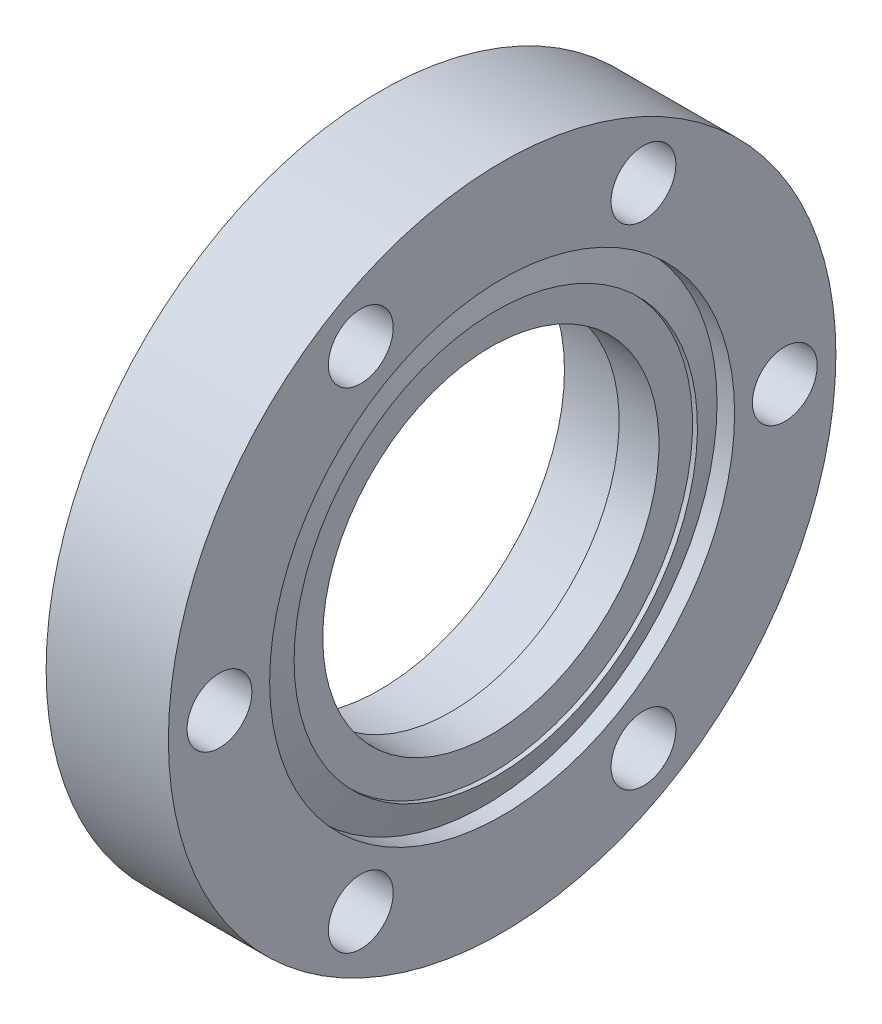
ISO-10303-21;
HEADER;
FILE_DESCRIPTION(('STEP AP214'),'2;1');
FILE_NAME('part.step','',(''),(''),'','','');
FILE_SCHEMA(('AUTOMOTIVE_DESIGN { 1 0 10303 214 1 1 1 1 }'));
ENDSEC;
DATA;
#1=APPLICATION_CONTEXT('core data for automotive mechanical design processes');
#2=APPLICATION_PROTOCOL_DEFINITION('international standard','automotive_design',2000,#1);
#3=PRODUCT_CONTEXT('',#1,'mechanical');
#4=PRODUCT('Part','Part','',(#3));
#5=PRODUCT_RELATED_PRODUCT_CATEGORY('part','',(#4));
#6=PRODUCT_DEFINITION_FORMATION('','',#4);
#7=PRODUCT_DEFINITION_CONTEXT('part definition',#1,'design');
#8=PRODUCT_DEFINITION('design','',#6,#7);
#9=PRODUCT_DEFINITION_SHAPE('','',#8);
#10=(LENGTH_UNIT() NAMED_UNIT(*) SI_UNIT(.MILLI.,.METRE.));
#11=(NAMED_UNIT(*) PLANE_ANGLE_UNIT() SI_UNIT($,.RADIAN.));
#12=(NAMED_UNIT(*) SI_UNIT($,.STERADIAN.) SOLID_ANGLE_UNIT());
#13=UNCERTAINTY_MEASURE_WITH_UNIT(LENGTH_MEASURE(1.E-05),#10,'distance_accuracy_value','');
#14=(GEOMETRIC_REPRESENTATION_CONTEXT(3) GLOBAL_UNCERTAINTY_ASSIGNED_CONTEXT((#13)) GLOBAL_UNIT_ASSIGNED_CONTEXT((#10,
#11,#12)) REPRESENTATION_CONTEXT('',''));
#15=CARTESIAN_POINT('',(0.,0.,0.));
#16=DIRECTION('',(0.,0.,1.));
#17=DIRECTION('',(1.,0.,0.));
#18=AXIS2_PLACEMENT_3D('',#15,#16,#17);
#19=CARTESIAN_POINT('',(5.18000000000051,-19.2062500000005,0.));
#20=DIRECTION('',(1.,0.,0.));
#21=DIRECTION('',(0.,0.,-1.));
#22=AXIS2_PLACEMENT_3D('',#19,#20,#21);
#23=PLANE('',#22);
#24=CARTESIAN_POINT('',(5.18000000000051,0.,0.));
#25=DIRECTION('',(-1.,0.,0.));
#26=DIRECTION('',(0.,0.,1.));
#27=AXIS2_PLACEMENT_3D('',#24,#25,#26);
#28=CIRCLE('',#27,17.4625);
#29=CARTESIAN_POINT('',(5.18000000000051,0.,17.4625));
#30=VERTEX_POINT('',#29);
#31=EDGE_CURVE('E18',#30,#30,#28,.T.);
#32=ORIENTED_EDGE('',*,*,#31,.T.);
#33=EDGE_LOOP('',(#32));
#34=FACE_BOUND('',#33,.T.);
#35=CARTESIAN_POINT('',(5.18000000000051,0.,0.));
#36=DIRECTION('',(-1.,0.,0.));
#37=DIRECTION('',(0.,0.,1.));
#38=AXIS2_PLACEMENT_3D('',#35,#36,#37);
#39=CIRCLE('',#38,20.950000000001);
#40=CARTESIAN_POINT('',(5.18000000000051,0.,20.950000000001));
#41=VERTEX_POINT('',#40);
#42=EDGE_CURVE('E81',#41,#41,#39,.F.);
#43=ORIENTED_EDGE('',*,*,#42,.T.);
#44=EDGE_LOOP('',(#43));
#45=FACE_BOUND('',#44,.T.);
#46=ADVANCED_FACE('F14',(#34,#45),#23,.T.);
#47=CARTESIAN_POINT('',(3.11069999999995,0.,0.));
#48=DIRECTION('',(-1.,0.,0.));
#49=DIRECTION('',(0.,0.,1.));
#50=AXIS2_PLACEMENT_3D('',#47,#48,#49);
#51=CYLINDRICAL_SURFACE('',#50,17.4625);
#52=CARTESIAN_POINT('',(1.04139999999939,0.,0.));
#53=DIRECTION('',(-1.,0.,0.));
#54=DIRECTION('',(0.,0.,1.));
#55=AXIS2_PLACEMENT_3D('',#52,#53,#54);
#56=CIRCLE('',#55,17.4625);
#57=CARTESIAN_POINT('',(1.04139999999939,0.,17.4625));
#58=VERTEX_POINT('',#57);
#59=EDGE_CURVE('E79',#58,#58,#56,.F.);
#60=ORIENTED_EDGE('',*,*,#59,.F.);
#61=EDGE_LOOP('',(#60));
#62=FACE_BOUND('',#61,.T.);
#63=ORIENTED_EDGE('',*,*,#31,.F.);
#64=EDGE_LOOP('',(#63));
#65=FACE_BOUND('',#64,.T.);
#66=ADVANCED_FACE('F89',(#62,#65),#51,.F.);
#67=CARTESIAN_POINT('',(5.43499999999988,0.,0.));
#68=DIRECTION('',(-1.,0.,0.));
#69=DIRECTION('',(0.,0.,1.));
#70=AXIS2_PLACEMENT_3D('',#67,#68,#69);
#71=CYLINDRICAL_SURFACE('',#70,20.950000000001);
#72=ORIENTED_EDGE('',*,*,#42,.F.);
#73=EDGE_LOOP('',(#72));
#74=FACE_BOUND('',#73,.T.);
#75=CARTESIAN_POINT('',(5.69000000223288,0.,0.));
#76=DIRECTION('',(-1.,0.,0.));
#77=DIRECTION('',(0.,-1.,0.));
#78=AXIS2_PLACEMENT_3D('',#75,#76,#77);
#79=CIRCLE('',#78,20.950000000814);
#80=CARTESIAN_POINT('',(5.69000000223288,-20.950000000814,0.));
#81=VERTEX_POINT('',#80);
#82=EDGE_CURVE('E78',#81,#81,#79,.T.);
#83=ORIENTED_EDGE('',*,*,#82,.F.);
#84=EDGE_LOOP('',(#83));
#85=FACE_BOUND('',#84,.T.);
#86=ADVANCED_FACE('F91',(#74,#85),#71,.F.);
#87=CARTESIAN_POINT('',(1.04139999999939,-18.3197499999999,0.));
#88=DIRECTION('',(-1.,0.,0.));
#89=DIRECTION('',(0.,0.,1.));
#90=AXIS2_PLACEMENT_3D('',#87,#88,#89);
#91=PLANE('',#90);
#92=ORIENTED_EDGE('',*,*,#59,.T.);
#93=EDGE_LOOP('',(#92));
#94=FACE_BOUND('',#93,.T.);
#95=CARTESIAN_POINT('',(1.04139999999939,0.,0.));
#96=DIRECTION('',(-1.,0.,0.));
#97=DIRECTION('',(0.,0.,1.));
#98=AXIS2_PLACEMENT_3D('',#95,#96,#97);
#99=CIRCLE('',#98,19.1769999999999);
#100=CARTESIAN_POINT('',(1.04139999999939,0.,19.1769999999999));
#101=VERTEX_POINT('',#100);
#102=EDGE_CURVE('E75',#101,#101,#99,.T.);
#103=ORIENTED_EDGE('',*,*,#102,.T.);
#104=EDGE_LOOP('',(#103));
#105=FACE_BOUND('',#104,.T.);
#106=ADVANCED_FACE('F99',(#94,#105),#91,.T.);
#107=CARTESIAN_POINT('',(4.52529524811392,0.,0.));
#108=DIRECTION('',(-1.,0.,0.));
#109=DIRECTION('',(0.,0.,1.));
#110=AXIS2_PLACEMENT_3D('',#107,#108,#109);
#111=CONICAL_SURFACE('',#110,24.1499999991873,1.22173047499998);
#112=ORIENTED_EDGE('',*,*,#82,.T.);
#113=EDGE_LOOP('',(#112));
#114=FACE_BOUND('',#113,.T.);
#115=CARTESIAN_POINT('',(4.52529525034756,0.,0.));
#116=DIRECTION('',(-1.,0.,0.));
#117=DIRECTION('',(0.,0.,1.));
#118=AXIS2_PLACEMENT_3D('',#115,#116,#117);
#119=CIRCLE('',#118,24.1500000000003);
#120=CARTESIAN_POINT('',(4.52529525034756,0.,24.1500000000003));
#121=VERTEX_POINT('',#120);
#122=EDGE_CURVE('E74',#121,#121,#119,.F.);
#123=ORIENTED_EDGE('',*,*,#122,.T.);
#124=EDGE_LOOP('',(#123));
#125=FACE_BOUND('',#124,.T.);
#126=ADVANCED_FACE('F127',(#114,#125),#111,.T.);
#127=CARTESIAN_POINT('',(-2.65429999999995,0.,0.));
#128=DIRECTION('',(-1.,0.,0.));
#129=DIRECTION('',(0.,0.,1.));
#130=AXIS2_PLACEMENT_3D('',#127,#128,#129);
#131=CYLINDRICAL_SURFACE('',#130,19.1769999999999);
#132=CARTESIAN_POINT('',(-6.34999999999929,0.,0.));
#133=DIRECTION('',(-1.,0.,0.));
#134=DIRECTION('',(0.,0.,1.));
#135=AXIS2_PLACEMENT_3D('',#132,#133,#134);
#136=CIRCLE('',#135,19.1769999999999);
#137=CARTESIAN_POINT('',(-6.34999999999929,0.,19.1769999999999));
#138=VERTEX_POINT('',#137);
#139=EDGE_CURVE('E53',#138,#138,#136,.F.);
#140=ORIENTED_EDGE('',*,*,#139,.F.);
#141=EDGE_LOOP('',(#140));
#142=FACE_BOUND('',#141,.T.);
#143=ORIENTED_EDGE('',*,*,#102,.F.);
#144=EDGE_LOOP('',(#143));
#145=FACE_BOUND('',#144,.T.);
#146=ADVANCED_FACE('F123',(#142,#145),#131,.F.);
#147=CARTESIAN_POINT('',(6.34999999999939,-25.4285843160799,14.6811999999998));
#148=DIRECTION('',(-1.,0.,0.));
#149=DIRECTION('',(0.,0.,1.));
#150=AXIS2_PLACEMENT_3D('',#147,#148,#149);
#151=CYLINDRICAL_SURFACE('',#150,3.36550000000002);
#152=CARTESIAN_POINT('',(6.34999999999937,-25.4285843160799,14.6811999999998));
#153=DIRECTION('',(-1.,0.,0.));
#154=DIRECTION('',(0.,0.,1.));
#155=AXIS2_PLACEMENT_3D('',#152,#153,#154);
#156=CIRCLE('',#155,3.36550000000002);
#157=CARTESIAN_POINT('',(6.34999999999937,-25.4285843160799,18.0466999999999));
#158=VERTEX_POINT('',#157);
#159=EDGE_CURVE('E50',#158,#158,#156,.T.);
#160=ORIENTED_EDGE('',*,*,#159,.F.);
#161=EDGE_LOOP('',(#160));
#162=FACE_BOUND('',#161,.T.);
#163=CARTESIAN_POINT('',(-6.34999999999929,-25.4285843160799,14.6811999999998));
#164=DIRECTION('',(-1.,0.,0.));
#165=DIRECTION('',(0.,0.,1.));
#166=AXIS2_PLACEMENT_3D('',#163,#164,#165);
#167=CIRCLE('',#166,3.36550000000002);
#168=CARTESIAN_POINT('',(-6.34999999999929,-25.4285843160799,18.0466999999999));
#169=VERTEX_POINT('',#168);
#170=EDGE_CURVE('E71',#169,#169,#167,.F.);
#171=ORIENTED_EDGE('',*,*,#170,.F.);
#172=EDGE_LOOP('',(#171));
#173=FACE_BOUND('',#172,.T.);
#174=ADVANCED_FACE('F126',(#162,#173),#151,.F.);
#175=CARTESIAN_POINT('',(6.34999999999939,0.,29.3623999999996));
#176=DIRECTION('',(-1.,0.,0.));
#177=DIRECTION('',(0.,0.,1.));
#178=AXIS2_PLACEMENT_3D('',#175,#176,#177);
#179=CYLINDRICAL_SURFACE('',#178,3.3655);
#180=CARTESIAN_POINT('',(6.34999999999937,0.,29.3623999999996));
#181=DIRECTION('',(-1.,0.,0.));
#182=DIRECTION('',(0.,0.,1.));
#183=AXIS2_PLACEMENT_3D('',#180,#181,#182);
#184=CIRCLE('',#183,3.3655);
#185=CARTESIAN_POINT('',(6.34999999999937,0.,32.7278999999996));
#186=VERTEX_POINT('',#185);
#187=EDGE_CURVE('E47',#186,#186,#184,.T.);
#188=ORIENTED_EDGE('',*,*,#187,.F.);
#189=EDGE_LOOP('',(#188));
#190=FACE_BOUND('',#189,.T.);
#191=CARTESIAN_POINT('',(-6.34999999999929,0.,29.3623999999996));
#192=DIRECTION('',(-1.,0.,0.));
#193=DIRECTION('',(0.,0.,1.));
#194=AXIS2_PLACEMENT_3D('',#191,#192,#193);
#195=CIRCLE('',#194,3.3655);
#196=CARTESIAN_POINT('',(-6.34999999999929,0.,32.7278999999996));
#197=VERTEX_POINT('',#196);
#198=EDGE_CURVE('E68',#197,#197,#195,.F.);
#199=ORIENTED_EDGE('',*,*,#198,.F.);
#200=EDGE_LOOP('',(#199));
#201=FACE_BOUND('',#200,.T.);
#202=ADVANCED_FACE('F158',(#190,#201),#179,.F.);
#203=CARTESIAN_POINT('',(6.34999999999939,25.4285843160799,14.6811999999998));
#204=DIRECTION('',(-1.,0.,0.));
#205=DIRECTION('',(0.,0.,1.));
#206=AXIS2_PLACEMENT_3D('',#203,#204,#205);
#207=CYLINDRICAL_SURFACE('',#206,3.36549999999999);
#208=CARTESIAN_POINT('',(6.34999999999937,25.4285843160799,14.6811999999998));
#209=DIRECTION('',(-1.,0.,0.));
#210=DIRECTION('',(0.,0.,1.));
#211=AXIS2_PLACEMENT_3D('',#208,#209,#210);
#212=CIRCLE('',#211,3.36549999999999);
#213=CARTESIAN_POINT('',(6.34999999999937,25.4285843160799,18.0466999999998));
#214=VERTEX_POINT('',#213);
#215=EDGE_CURVE('E44',#214,#214,#212,.T.);
#216=ORIENTED_EDGE('',*,*,#215,.F.);
#217=EDGE_LOOP('',(#216));
#218=FACE_BOUND('',#217,.T.);
#219=CARTESIAN_POINT('',(-6.34999999999929,25.4285843160799,14.6811999999998));
#220=DIRECTION('',(-1.,0.,0.));
#221=DIRECTION('',(0.,0.,1.));
#222=AXIS2_PLACEMENT_3D('',#219,#220,#221);
#223=CIRCLE('',#222,3.36549999999999);
#224=CARTESIAN_POINT('',(-6.34999999999929,25.4285843160799,18.0466999999998));
#225=VERTEX_POINT('',#224);
#226=EDGE_CURVE('E65',#225,#225,#223,.F.);
#227=ORIENTED_EDGE('',*,*,#226,.F.);
#228=EDGE_LOOP('',(#227));
#229=FACE_BOUND('',#228,.T.);
#230=ADVANCED_FACE('F166',(#218,#229),#207,.F.);
#231=CARTESIAN_POINT('',(6.34999999999939,25.4285843160799,-14.6811999999998));
#232=DIRECTION('',(-1.,0.,0.));
#233=DIRECTION('',(0.,0.,1.));
#234=AXIS2_PLACEMENT_3D('',#231,#232,#233);
#235=CYLINDRICAL_SURFACE('',#234,3.3655);
#236=CARTESIAN_POINT('',(6.34999999999937,25.4285843160799,-14.6811999999998));
#237=DIRECTION('',(-1.,0.,0.));
#238=DIRECTION('',(0.,0.,1.));
#239=AXIS2_PLACEMENT_3D('',#236,#237,#238);
#240=CIRCLE('',#239,3.3655);
#241=CARTESIAN_POINT('',(6.34999999999937,25.4285843160799,-11.3156999999998));
#242=VERTEX_POINT('',#241);
#243=EDGE_CURVE('E41',#242,#242,#240,.T.);
#244=ORIENTED_EDGE('',*,*,#243,.F.);
#245=EDGE_LOOP('',(#244));
#246=FACE_BOUND('',#245,.T.);
#247=CARTESIAN_POINT('',(-6.34999999999929,25.4285843160799,-14.6811999999998));
#248=DIRECTION('',(-1.,0.,0.));
#249=DIRECTION('',(0.,0.,1.));
#250=AXIS2_PLACEMENT_3D('',#247,#248,#249);
#251=CIRCLE('',#250,3.3655);
#252=CARTESIAN_POINT('',(-6.34999999999929,25.4285843160799,-11.3156999999998));
#253=VERTEX_POINT('',#252);
#254=EDGE_CURVE('E62',#253,#253,#251,.F.);
#255=ORIENTED_EDGE('',*,*,#254,.F.);
#256=EDGE_LOOP('',(#255));
#257=FACE_BOUND('',#256,.T.);
#258=ADVANCED_FACE('F174',(#246,#257),#235,.F.);
#259=CARTESIAN_POINT('',(6.34999999999939,-25.4285843160799,-14.6811999999998));
#260=DIRECTION('',(-1.,0.,0.));
#261=DIRECTION('',(0.,0.,1.));
#262=AXIS2_PLACEMENT_3D('',#259,#260,#261);
#263=CYLINDRICAL_SURFACE('',#262,3.3655);
#264=CARTESIAN_POINT('',(6.34999999999937,-25.4285843160799,-14.6811999999998));
#265=DIRECTION('',(-1.,0.,0.));
#266=DIRECTION('',(0.,0.,1.));
#267=AXIS2_PLACEMENT_3D('',#264,#265,#266);
#268=CIRCLE('',#267,3.3655);
#269=CARTESIAN_POINT('',(6.34999999999937,-25.4285843160799,-11.3156999999998));
#270=VERTEX_POINT('',#269);
#271=EDGE_CURVE('E38',#270,#270,#268,.T.);
#272=ORIENTED_EDGE('',*,*,#271,.F.);
#273=EDGE_LOOP('',(#272));
#274=FACE_BOUND('',#273,.T.);
#275=CARTESIAN_POINT('',(-6.34999999999929,-25.4285843160799,-14.6811999999998));
#276=DIRECTION('',(-1.,0.,0.));
#277=DIRECTION('',(0.,0.,1.));
#278=AXIS2_PLACEMENT_3D('',#275,#276,#277);
#279=CIRCLE('',#278,3.3655);
#280=CARTESIAN_POINT('',(-6.34999999999929,-25.4285843160799,-11.3156999999998));
#281=VERTEX_POINT('',#280);
#282=EDGE_CURVE('E59',#281,#281,#279,.F.);
#283=ORIENTED_EDGE('',*,*,#282,.F.);
#284=EDGE_LOOP('',(#283));
#285=FACE_BOUND('',#284,.T.);
#286=ADVANCED_FACE('F182',(#274,#285),#263,.F.);
#287=CARTESIAN_POINT('',(6.34999999999939,0.,-29.3623999999996));
#288=DIRECTION('',(-1.,0.,0.));
#289=DIRECTION('',(0.,0.,1.));
#290=AXIS2_PLACEMENT_3D('',#287,#288,#289);
#291=CYLINDRICAL_SURFACE('',#290,3.3655);
#292=CARTESIAN_POINT('',(6.34999999999937,0.,-29.3623999999996));
#293=DIRECTION('',(-1.,0.,0.));
#294=DIRECTION('',(0.,0.,1.));
#295=AXIS2_PLACEMENT_3D('',#292,#293,#294);
#296=CIRCLE('',#295,3.3655);
#297=CARTESIAN_POINT('',(6.34999999999937,0.,-25.9968999999996));
#298=VERTEX_POINT('',#297);
#299=EDGE_CURVE('E35',#298,#298,#296,.T.);
#300=ORIENTED_EDGE('',*,*,#299,.F.);
#301=EDGE_LOOP('',(#300));
#302=FACE_BOUND('',#301,.T.);
#303=CARTESIAN_POINT('',(-6.34999999999929,0.,-29.3623999999996));
#304=DIRECTION('',(-1.,0.,0.));
#305=DIRECTION('',(0.,0.,1.));
#306=AXIS2_PLACEMENT_3D('',#303,#304,#305);
#307=CIRCLE('',#306,3.3655);
#308=CARTESIAN_POINT('',(-6.34999999999929,0.,-25.9968999999996));
#309=VERTEX_POINT('',#308);
#310=EDGE_CURVE('E56',#309,#309,#307,.F.);
#311=ORIENTED_EDGE('',*,*,#310,.F.);
#312=EDGE_LOOP('',(#311));
#313=FACE_BOUND('',#312,.T.);
#314=ADVANCED_FACE('F16',(#302,#313),#291,.F.);
#315=CARTESIAN_POINT('',(5.43764762517347,0.,0.));
#316=DIRECTION('',(-1.,0.,0.));
#317=DIRECTION('',(0.,0.,1.));
#318=AXIS2_PLACEMENT_3D('',#315,#316,#317);
#319=CYLINDRICAL_SURFACE('',#318,24.1500000000003);
#320=ORIENTED_EDGE('',*,*,#122,.F.);
#321=EDGE_LOOP('',(#320));
#322=FACE_BOUND('',#321,.T.);
#323=CARTESIAN_POINT('',(6.34999999999937,0.,0.));
#324=DIRECTION('',(-1.,0.,0.));
#325=DIRECTION('',(0.,0.,1.));
#326=AXIS2_PLACEMENT_3D('',#323,#324,#325);
#327=CIRCLE('',#326,24.1500000000003);
#328=CARTESIAN_POINT('',(6.34999999999937,0.,24.1500000000003));
#329=VERTEX_POINT('',#328);
#330=EDGE_CURVE('E27',#329,#329,#327,.T.);
#331=ORIENTED_EDGE('',*,*,#330,.F.);
#332=EDGE_LOOP('',(#331));
#333=FACE_BOUND('',#332,.T.);
#334=ADVANCED_FACE('F118',(#322,#333),#319,.F.);
#335=CARTESIAN_POINT('',(-6.34999999999929,-26.9240000000001,0.));
#336=DIRECTION('',(-1.,0.,0.));
#337=DIRECTION('',(0.,0.,1.));
#338=AXIS2_PLACEMENT_3D('',#335,#336,#337);
#339=PLANE('',#338);
#340=ORIENTED_EDGE('',*,*,#139,.T.);
#341=EDGE_LOOP('',(#340));
#342=FACE_BOUND('',#341,.T.);
#343=ORIENTED_EDGE('',*,*,#310,.T.);
#344=EDGE_LOOP('',(#343));
#345=FACE_BOUND('',#344,.T.);
#346=ORIENTED_EDGE('',*,*,#282,.T.);
#347=EDGE_LOOP('',(#346));
#348=FACE_BOUND('',#347,.T.);
#349=ORIENTED_EDGE('',*,*,#254,.T.);
#350=EDGE_LOOP('',(#349));
#351=FACE_BOUND('',#350,.T.);
#352=ORIENTED_EDGE('',*,*,#226,.T.);
#353=EDGE_LOOP('',(#352));
#354=FACE_BOUND('',#353,.T.);
#355=ORIENTED_EDGE('',*,*,#198,.T.);
#356=EDGE_LOOP('',(#355));
#357=FACE_BOUND('',#356,.T.);
#358=ORIENTED_EDGE('',*,*,#170,.T.);
#359=EDGE_LOOP('',(#358));
#360=FACE_BOUND('',#359,.T.);
#361=CARTESIAN_POINT('',(-6.34999999999929,0.,0.));
#362=DIRECTION('',(-1.,0.,0.));
#363=DIRECTION('',(0.,0.,1.));
#364=AXIS2_PLACEMENT_3D('',#361,#362,#363);
#365=CIRCLE('',#364,34.6710000000003);
#366=CARTESIAN_POINT('',(-6.34999999999929,0.,34.6710000000003));
#367=VERTEX_POINT('',#366);
#368=EDGE_CURVE('E22',#367,#367,#365,.F.);
#369=ORIENTED_EDGE('',*,*,#368,.F.);
#370=EDGE_LOOP('',(#369));
#371=FACE_BOUND('',#370,.T.);
#372=ADVANCED_FACE('F111',(#342,#345,#348,#351,#354,#357,#360,#371),#339,.T.);
#373=CARTESIAN_POINT('',(6.34999999999937,-29.4105000000003,0.));
#374=DIRECTION('',(1.,0.,0.));
#375=DIRECTION('',(0.,0.,-1.));
#376=AXIS2_PLACEMENT_3D('',#373,#374,#375);
#377=PLANE('',#376);
#378=ORIENTED_EDGE('',*,*,#330,.T.);
#379=EDGE_LOOP('',(#378));
#380=FACE_BOUND('',#379,.T.);
#381=ORIENTED_EDGE('',*,*,#299,.T.);
#382=EDGE_LOOP('',(#381));
#383=FACE_BOUND('',#382,.T.);
#384=ORIENTED_EDGE('',*,*,#271,.T.);
#385=EDGE_LOOP('',(#384));
#386=FACE_BOUND('',#385,.T.);
#387=ORIENTED_EDGE('',*,*,#243,.T.);
#388=EDGE_LOOP('',(#387));
#389=FACE_BOUND('',#388,.T.);
#390=ORIENTED_EDGE('',*,*,#215,.T.);
#391=EDGE_LOOP('',(#390));
#392=FACE_BOUND('',#391,.T.);
#393=ORIENTED_EDGE('',*,*,#187,.T.);
#394=EDGE_LOOP('',(#393));
#395=FACE_BOUND('',#394,.T.);
#396=ORIENTED_EDGE('',*,*,#159,.T.);
#397=EDGE_LOOP('',(#396));
#398=FACE_BOUND('',#397,.T.);
#399=CARTESIAN_POINT('',(6.34999999999937,0.,0.));
#400=DIRECTION('',(-1.,0.,0.));
#401=DIRECTION('',(0.,0.,1.));
#402=AXIS2_PLACEMENT_3D('',#399,#400,#401);
#403=CIRCLE('',#402,34.6710000000003);
#404=CARTESIAN_POINT('',(6.34999999999937,0.,34.6710000000003));
#405=VERTEX_POINT('',#404);
#406=EDGE_CURVE('E10',#405,#405,#403,.T.);
#407=ORIENTED_EDGE('',*,*,#406,.F.);
#408=EDGE_LOOP('',(#407));
#409=FACE_BOUND('',#408,.T.);
#410=ADVANCED_FACE('F106',(#380,#383,#386,#389,#392,#395,#398,#409),#377,.T.);
#411=CARTESIAN_POINT('',(0.,0.,0.));
#412=DIRECTION('',(-1.,0.,0.));
#413=DIRECTION('',(0.,0.,1.));
#414=AXIS2_PLACEMENT_3D('',#411,#412,#413);
#415=CYLINDRICAL_SURFACE('',#414,34.6710000000003);
#416=ORIENTED_EDGE('',*,*,#406,.T.);
#417=EDGE_LOOP('',(#416));
#418=FACE_BOUND('',#417,.T.);
#419=ORIENTED_EDGE('',*,*,#368,.T.);
#420=EDGE_LOOP('',(#419));
#421=FACE_BOUND('',#420,.T.);
#422=ADVANCED_FACE('F104',(#418,#421),#415,.T.);
#423=CLOSED_SHELL('',(#46,#66,#86,#106,#126,#146,#174,#202,#230,#258,#286,#314,#334,#372,#410,#422));
#424=MANIFOLD_SOLID_BREP('B1',#423);
#425=ADVANCED_BREP_SHAPE_REPRESENTATION('',(#18,#424),#14);
#426=SHAPE_DEFINITION_REPRESENTATION(#9,#425);
ENDSEC;
END-ISO-10303-21;
